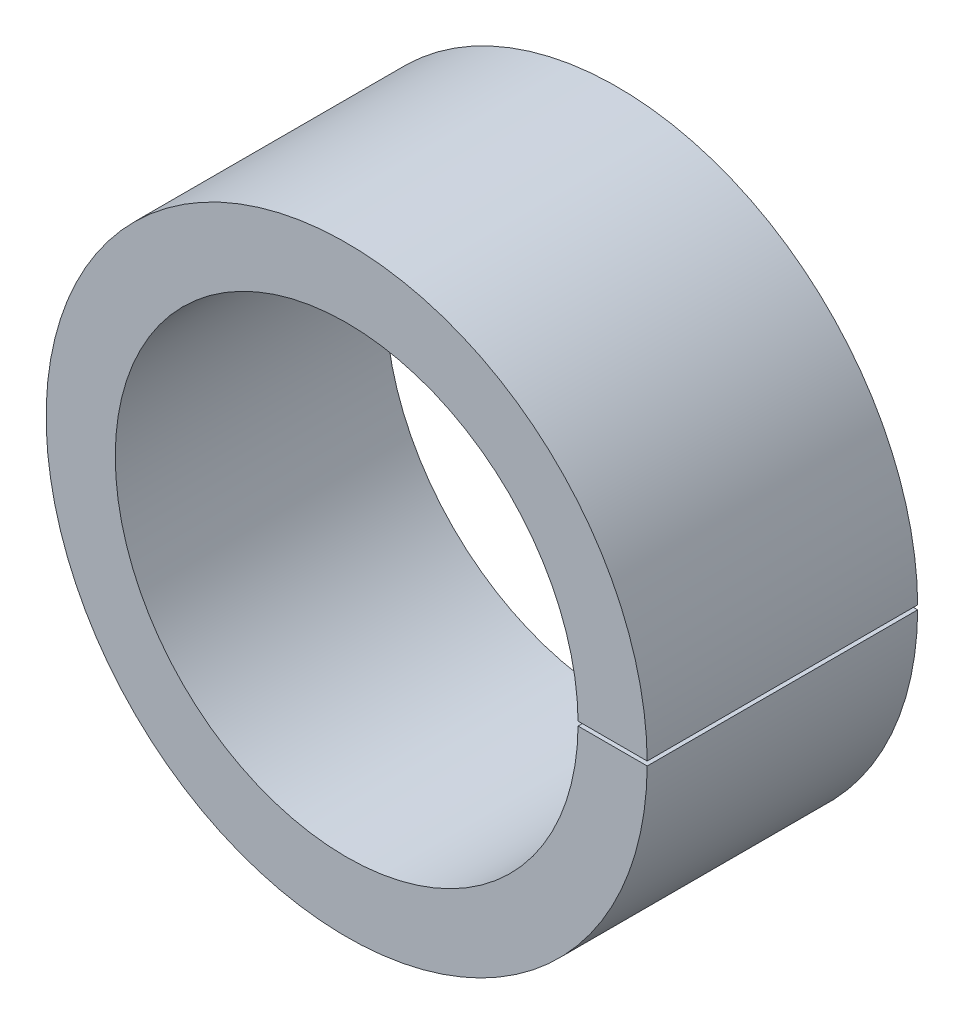
ISO-10303-21;
HEADER;
FILE_DESCRIPTION(('STEP AP214'),'2;1');
FILE_NAME('part.step','',(''),(''),'','','');
FILE_SCHEMA(('AUTOMOTIVE_DESIGN { 1 0 10303 214 1 1 1 1 }'));
ENDSEC;
DATA;
#1=APPLICATION_CONTEXT('core data for automotive mechanical design processes');
#2=APPLICATION_PROTOCOL_DEFINITION('international standard','automotive_design',2000,#1);
#3=PRODUCT_CONTEXT('',#1,'mechanical');
#4=PRODUCT('Part','Part','',(#3));
#5=PRODUCT_RELATED_PRODUCT_CATEGORY('part','',(#4));
#6=PRODUCT_DEFINITION_FORMATION('','',#4);
#7=PRODUCT_DEFINITION_CONTEXT('part definition',#1,'design');
#8=PRODUCT_DEFINITION('design','',#6,#7);
#9=PRODUCT_DEFINITION_SHAPE('','',#8);
#10=(LENGTH_UNIT() NAMED_UNIT(*) SI_UNIT(.MILLI.,.METRE.));
#11=(NAMED_UNIT(*) PLANE_ANGLE_UNIT() SI_UNIT($,.RADIAN.));
#12=(NAMED_UNIT(*) SI_UNIT($,.STERADIAN.) SOLID_ANGLE_UNIT());
#13=UNCERTAINTY_MEASURE_WITH_UNIT(LENGTH_MEASURE(1.E-05),#10,'distance_accuracy_value','');
#14=(GEOMETRIC_REPRESENTATION_CONTEXT(3) GLOBAL_UNCERTAINTY_ASSIGNED_CONTEXT((#13)) GLOBAL_UNIT_ASSIGNED_CONTEXT((#10,
#11,#12)) REPRESENTATION_CONTEXT('',''));
#15=CARTESIAN_POINT('',(0.,0.,0.));
#16=DIRECTION('',(0.,0.,1.));
#17=DIRECTION('',(1.,0.,0.));
#18=AXIS2_PLACEMENT_3D('',#15,#16,#17);
#19=CARTESIAN_POINT('',(0.,0.,4.7625));
#20=DIRECTION('',(0.,0.,-1.));
#21=DIRECTION('',(-1.,0.,0.));
#22=AXIS2_PLACEMENT_3D('',#19,#20,#21);
#23=CYLINDRICAL_SURFACE('',#22,6.35);
#24=CARTESIAN_POINT('',(0.,0.,-0.952500000000002));
#25=DIRECTION('',(0.,0.,-1.));
#26=DIRECTION('',(-1.,0.,0.));
#27=AXIS2_PLACEMENT_3D('',#24,#25,#26);
#28=CIRCLE('',#27,6.35);
#29=CARTESIAN_POINT('',(6.34984054917917,-0.045,-0.952500000000002));
#30=VERTEX_POINT('',#29);
#31=CARTESIAN_POINT('',(6.34984054917917,0.0450000000000023,-0.952500000000002));
#32=VERTEX_POINT('',#31);
#33=EDGE_CURVE('E46',#30,#32,#28,.T.);
#34=ORIENTED_EDGE('',*,*,#33,.F.);
#35=DIRECTION('',(0.,0.,-1.));
#36=VECTOR('',#35,1.);
#37=CARTESIAN_POINT('',(6.34984054917917,-0.045,4.7625));
#38=LINE('',#37,#36);
#39=CARTESIAN_POINT('',(6.34984054917917,-0.045,4.7625));
#40=VERTEX_POINT('',#39);
#41=EDGE_CURVE('E40',#40,#30,#38,.T.);
#42=ORIENTED_EDGE('',*,*,#41,.F.);
#43=CARTESIAN_POINT('',(0.,0.,4.7625));
#44=DIRECTION('',(0.,0.,1.));
#45=DIRECTION('',(1.,0.,0.));
#46=AXIS2_PLACEMENT_3D('',#43,#44,#45);
#47=CIRCLE('',#46,6.35);
#48=CARTESIAN_POINT('',(6.34984054917917,0.0450000000000023,4.7625));
#49=VERTEX_POINT('',#48);
#50=EDGE_CURVE('E100',#49,#40,#47,.T.);
#51=ORIENTED_EDGE('',*,*,#50,.F.);
#52=DIRECTION('',(0.,0.,-1.));
#53=VECTOR('',#52,1.);
#54=CARTESIAN_POINT('',(6.34984054917917,0.0450000000000023,4.7625));
#55=LINE('',#54,#53);
#56=EDGE_CURVE('E88',#49,#32,#55,.T.);
#57=ORIENTED_EDGE('',*,*,#56,.T.);
#58=EDGE_LOOP('',(#34,#42,#51,#57));
#59=FACE_BOUND('',#58,.T.);
#60=ADVANCED_FACE('F33',(#59),#23,.T.);
#61=CARTESIAN_POINT('',(4.88929291922666,-0.045,4.7625));
#62=DIRECTION('',(0.,-1.,0.));
#63=DIRECTION('',(0.,0.,-1.));
#64=AXIS2_PLACEMENT_3D('',#61,#62,#63);
#65=PLANE('',#64);
#66=DIRECTION('',(1.,0.,0.));
#67=VECTOR('',#66,1.);
#68=CARTESIAN_POINT('',(4.88929291922666,-0.045,-0.952500000000002));
#69=LINE('',#68,#67);
#70=CARTESIAN_POINT('',(4.88929291922666,-0.045,-0.952500000000002));
#71=VERTEX_POINT('',#70);
#72=EDGE_CURVE('E85',#71,#30,#69,.T.);
#73=ORIENTED_EDGE('',*,*,#72,.F.);
#74=DIRECTION('',(0.,0.,-1.));
#75=VECTOR('',#74,1.);
#76=CARTESIAN_POINT('',(4.88929291922666,-0.045,4.7625));
#77=LINE('',#76,#75);
#78=CARTESIAN_POINT('',(4.88929291922666,-0.045,4.7625));
#79=VERTEX_POINT('',#78);
#80=EDGE_CURVE('E84',#79,#71,#77,.T.);
#81=ORIENTED_EDGE('',*,*,#80,.F.);
#82=DIRECTION('',(-1.,0.,0.));
#83=VECTOR('',#82,1.);
#84=CARTESIAN_POINT('',(4.88929291922666,-0.045,4.7625));
#85=LINE('',#84,#83);
#86=EDGE_CURVE('E97',#40,#79,#85,.T.);
#87=ORIENTED_EDGE('',*,*,#86,.F.);
#88=ORIENTED_EDGE('',*,*,#41,.T.);
#89=EDGE_LOOP('',(#73,#81,#87,#88));
#90=FACE_BOUND('',#89,.T.);
#91=ADVANCED_FACE('F96',(#90),#65,.F.);
#92=CARTESIAN_POINT('',(0.,0.,4.7625));
#93=DIRECTION('',(0.,0.,-1.));
#94=DIRECTION('',(-1.,0.,0.));
#95=AXIS2_PLACEMENT_3D('',#92,#93,#94);
#96=CYLINDRICAL_SURFACE('',#95,4.8895);
#97=CARTESIAN_POINT('',(0.,0.,-0.952500000000002));
#98=DIRECTION('',(0.,0.,-1.));
#99=DIRECTION('',(-1.,0.,0.));
#100=AXIS2_PLACEMENT_3D('',#97,#98,#99);
#101=CIRCLE('',#100,4.8895);
#102=CARTESIAN_POINT('',(4.88929291922666,0.0450000000000018,-0.952500000000002));
#103=VERTEX_POINT('',#102);
#104=EDGE_CURVE('E72',#103,#71,#101,.F.);
#105=ORIENTED_EDGE('',*,*,#104,.F.);
#106=DIRECTION('',(0.,0.,-1.));
#107=VECTOR('',#106,1.);
#108=CARTESIAN_POINT('',(4.88929291922666,0.0450000000000018,4.7625));
#109=LINE('',#108,#107);
#110=CARTESIAN_POINT('',(4.88929291922666,0.0450000000000018,4.7625));
#111=VERTEX_POINT('',#110);
#112=EDGE_CURVE('E82',#111,#103,#109,.T.);
#113=ORIENTED_EDGE('',*,*,#112,.F.);
#114=CARTESIAN_POINT('',(0.,0.,4.7625));
#115=DIRECTION('',(0.,0.,-1.));
#116=DIRECTION('',(1.,0.,0.));
#117=AXIS2_PLACEMENT_3D('',#114,#115,#116);
#118=CIRCLE('',#117,4.8895);
#119=EDGE_CURVE('E106',#79,#111,#118,.T.);
#120=ORIENTED_EDGE('',*,*,#119,.F.);
#121=ORIENTED_EDGE('',*,*,#80,.T.);
#122=EDGE_LOOP('',(#105,#113,#120,#121));
#123=FACE_BOUND('',#122,.T.);
#124=ADVANCED_FACE('F80',(#123),#96,.F.);
#125=CARTESIAN_POINT('',(4.88929291922666,0.0450000000000018,4.7625));
#126=DIRECTION('',(0.,1.,0.));
#127=DIRECTION('',(-1.,0.,0.));
#128=AXIS2_PLACEMENT_3D('',#125,#126,#127);
#129=PLANE('',#128);
#130=DIRECTION('',(-1.,0.,0.));
#131=VECTOR('',#130,1.);
#132=CARTESIAN_POINT('',(4.88929291922666,0.0450000000000018,-0.952500000000002));
#133=LINE('',#132,#131);
#134=EDGE_CURVE('E11',#32,#103,#133,.T.);
#135=ORIENTED_EDGE('',*,*,#134,.F.);
#136=ORIENTED_EDGE('',*,*,#56,.F.);
#137=DIRECTION('',(1.,0.,0.));
#138=VECTOR('',#137,1.);
#139=CARTESIAN_POINT('',(4.88929291922666,0.0450000000000018,4.7625));
#140=LINE('',#139,#138);
#141=EDGE_CURVE('E54',#111,#49,#140,.T.);
#142=ORIENTED_EDGE('',*,*,#141,.F.);
#143=ORIENTED_EDGE('',*,*,#112,.T.);
#144=EDGE_LOOP('',(#135,#136,#142,#143));
#145=FACE_BOUND('',#144,.T.);
#146=ADVANCED_FACE('F87',(#145),#129,.F.);
#147=CARTESIAN_POINT('',(0.,0.,4.7625));
#148=DIRECTION('',(0.,0.,1.));
#149=DIRECTION('',(1.,0.,0.));
#150=AXIS2_PLACEMENT_3D('',#147,#148,#149);
#151=PLANE('',#150);
#152=ORIENTED_EDGE('',*,*,#50,.T.);
#153=ORIENTED_EDGE('',*,*,#86,.T.);
#154=ORIENTED_EDGE('',*,*,#119,.T.);
#155=ORIENTED_EDGE('',*,*,#141,.T.);
#156=EDGE_LOOP('',(#152,#153,#154,#155));
#157=FACE_BOUND('',#156,.T.);
#158=ADVANCED_FACE('F107',(#157),#151,.T.);
#159=CARTESIAN_POINT('',(0.,0.,-0.952500000000002));
#160=DIRECTION('',(0.,0.,-1.));
#161=DIRECTION('',(-1.,0.,0.));
#162=AXIS2_PLACEMENT_3D('',#159,#160,#161);
#163=PLANE('',#162);
#164=ORIENTED_EDGE('',*,*,#33,.T.);
#165=ORIENTED_EDGE('',*,*,#134,.T.);
#166=ORIENTED_EDGE('',*,*,#104,.T.);
#167=ORIENTED_EDGE('',*,*,#72,.T.);
#168=EDGE_LOOP('',(#164,#165,#166,#167));
#169=FACE_BOUND('',#168,.T.);
#170=ADVANCED_FACE('F71',(#169),#163,.T.);
#171=CLOSED_SHELL('',(#60,#91,#124,#146,#158,#170));
#172=MANIFOLD_SOLID_BREP('B2',#171);
#173=ADVANCED_BREP_SHAPE_REPRESENTATION('',(#18,#172),#14);
#174=SHAPE_DEFINITION_REPRESENTATION(#9,#173);
ENDSEC;
END-ISO-10303-21;
